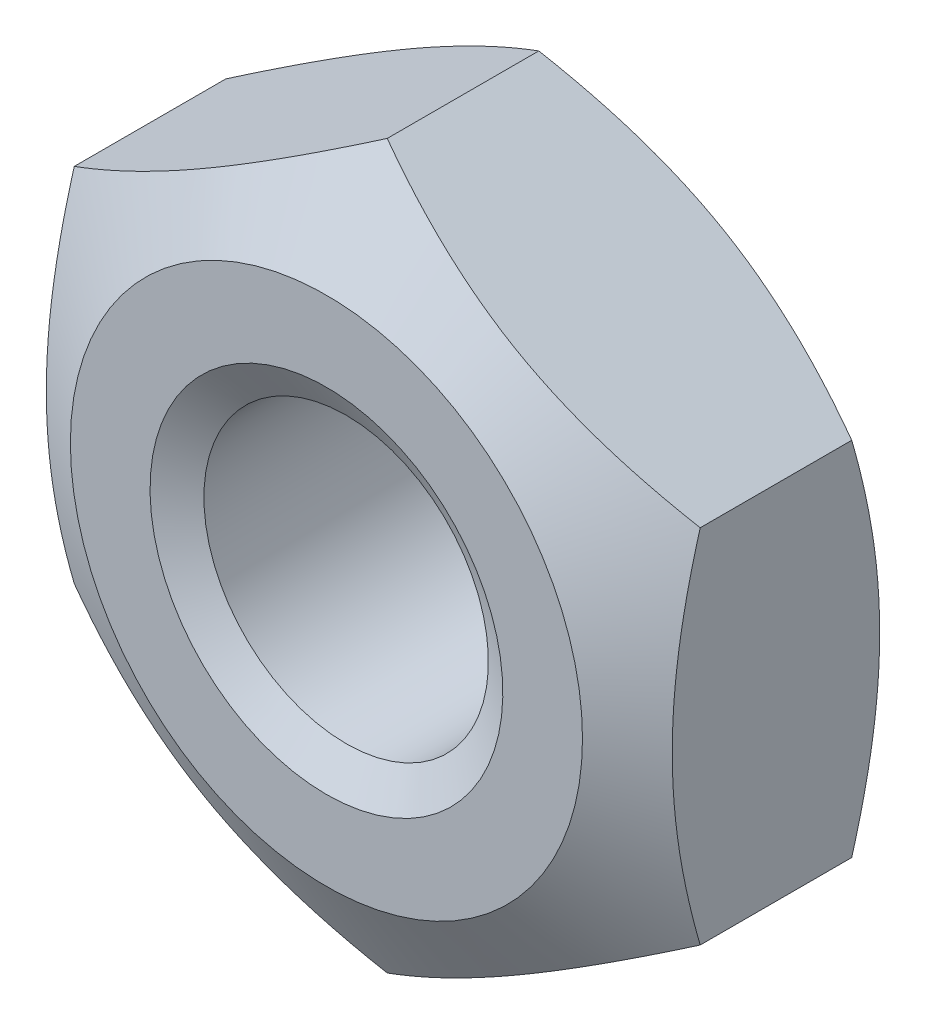
ISO-10303-21;
HEADER;
FILE_DESCRIPTION(('STEP AP214'),'2;1');
FILE_NAME('part.step','',(''),(''),'','','');
FILE_SCHEMA(('AUTOMOTIVE_DESIGN { 1 0 10303 214 1 1 1 1 }'));
ENDSEC;
DATA;
#1=APPLICATION_CONTEXT('core data for automotive mechanical design processes');
#2=APPLICATION_PROTOCOL_DEFINITION('international standard','automotive_design',2000,#1);
#3=PRODUCT_CONTEXT('',#1,'mechanical');
#4=PRODUCT('Part','Part','',(#3));
#5=PRODUCT_RELATED_PRODUCT_CATEGORY('part','',(#4));
#6=PRODUCT_DEFINITION_FORMATION('','',#4);
#7=PRODUCT_DEFINITION_CONTEXT('part definition',#1,'design');
#8=PRODUCT_DEFINITION('design','',#6,#7);
#9=PRODUCT_DEFINITION_SHAPE('','',#8);
#10=(LENGTH_UNIT() NAMED_UNIT(*) SI_UNIT(.MILLI.,.METRE.));
#11=(NAMED_UNIT(*) PLANE_ANGLE_UNIT() SI_UNIT($,.RADIAN.));
#12=(NAMED_UNIT(*) SI_UNIT($,.STERADIAN.) SOLID_ANGLE_UNIT());
#13=UNCERTAINTY_MEASURE_WITH_UNIT(LENGTH_MEASURE(1.E-05),#10,'distance_accuracy_value','');
#14=(GEOMETRIC_REPRESENTATION_CONTEXT(3) GLOBAL_UNCERTAINTY_ASSIGNED_CONTEXT((#13)) GLOBAL_UNIT_ASSIGNED_CONTEXT((#10,
#11,#12)) REPRESENTATION_CONTEXT('',''));
#15=CARTESIAN_POINT('',(0.,0.,0.));
#16=DIRECTION('',(0.,0.,1.));
#17=DIRECTION('',(1.,0.,0.));
#18=AXIS2_PLACEMENT_3D('',#15,#16,#17);
#19=CARTESIAN_POINT('',(0.,0.,-2.4));
#20=DIRECTION('',(0.,0.,1.));
#21=DIRECTION('',(1.,0.,0.));
#22=AXIS2_PLACEMENT_3D('',#19,#20,#21);
#23=PLANE('',#22);
#24=CARTESIAN_POINT('',(0.,0.,-2.4));
#25=DIRECTION('',(0.,0.,1.));
#26=DIRECTION('',(0.,-1.,0.));
#27=AXIS2_PLACEMENT_3D('',#24,#25,#26);
#28=CIRCLE('',#27,1.55);
#29=CARTESIAN_POINT('',(0.,1.55,-2.4));
#30=VERTEX_POINT('',#29);
#31=EDGE_CURVE('E139',#30,#30,#28,.T.);
#32=ORIENTED_EDGE('',*,*,#31,.T.);
#33=EDGE_LOOP('',(#32));
#34=FACE_BOUND('',#33,.T.);
#35=CARTESIAN_POINT('',(0.,0.,-2.4));
#36=DIRECTION('',(0.,0.,1.));
#37=DIRECTION('',(1.,0.,0.));
#38=AXIS2_PLACEMENT_3D('',#35,#36,#37);
#39=CIRCLE('',#38,2.25);
#40=CARTESIAN_POINT('',(-2.25,0.,-2.4));
#41=VERTEX_POINT('',#40);
#42=EDGE_CURVE('E146',#41,#41,#39,.T.);
#43=ORIENTED_EDGE('',*,*,#42,.F.);
#44=EDGE_LOOP('',(#43));
#45=FACE_BOUND('',#44,.T.);
#46=ADVANCED_FACE('F16',(#34,#45),#23,.F.);
#47=CARTESIAN_POINT('',(0.,3.17542648054294,-2.4));
#48=DIRECTION('',(-0.5,0.866025403784437,0.));
#49=DIRECTION('',(0.,0.,1.));
#50=AXIS2_PLACEMENT_3D('',#47,#48,#49);
#51=PLANE('',#50);
#52=DIRECTION('',(0.,0.,1.));
#53=VECTOR('',#52,1.);
#54=CARTESIAN_POINT('',(0.,3.17542648054294,-2.4));
#55=LINE('',#54,#53);
#56=CARTESIAN_POINT('',(0.,3.17542648054294,-1.86570477234333));
#57=VERTEX_POINT('',#56);
#58=CARTESIAN_POINT('',(0.,3.17542648054294,-0.534295227656671));
#59=VERTEX_POINT('',#58);
#60=EDGE_CURVE('E43',#57,#59,#55,.T.);
#61=ORIENTED_EDGE('',*,*,#60,.F.);
#62=CARTESIAN_POINT('',(0.,3.17542648054293,-1.86570477234333));
#63=CARTESIAN_POINT('',(-0.735198963222916,2.75095916121825,-2.11077109341981));
#64=CARTESIAN_POINT('',(-1.37237475922065,2.38308554387785,-2.11132390079117));
#65=CARTESIAN_POINT('',(-1.71319776991422,2.18631128690789,-2.11161959543906));
#66=CARTESIAN_POINT('',(-2.06913878457553,1.98080864627755,-2.04526079267445));
#67=CARTESIAN_POINT('',(-2.39178885101996,1.79452654356181,-1.98510848867109));
#68=CARTESIAN_POINT('',(-2.75000000000001,1.58771324027146,-1.86570477234333));
#69=B_SPLINE_CURVE_WITH_KNOTS('',2,(#62,#63,#64,#65,#66,#67,#68),.UNSPECIFIED.,.F.,.F.,(3,2,2,
3),(0.,0.5,0.75,1.),.UNSPECIFIED.);
#70=CARTESIAN_POINT('',(-2.75,1.58771324027145,-1.86570477234333));
#71=VERTEX_POINT('',#70);
#72=EDGE_CURVE('E204',#57,#71,#69,.T.);
#73=ORIENTED_EDGE('',*,*,#72,.T.);
#74=DIRECTION('',(0.,0.,1.));
#75=VECTOR('',#74,1.);
#76=CARTESIAN_POINT('',(-2.75,1.58771324027145,-2.4));
#77=LINE('',#76,#75);
#78=CARTESIAN_POINT('',(-2.75,1.58771324027145,-0.534295227656671));
#79=VERTEX_POINT('',#78);
#80=EDGE_CURVE('E11',#71,#79,#77,.T.);
#81=ORIENTED_EDGE('',*,*,#80,.T.);
#82=CARTESIAN_POINT('',(-2.75,1.58771324027146,-0.53429522765667));
#83=CARTESIAN_POINT('',(-2.01480103677526,2.0121805595972,-0.28922890657958));
#84=CARTESIAN_POINT('',(-1.37762524077936,2.38005417693655,-0.288676099208825));
#85=CARTESIAN_POINT('',(-1.03680223008299,2.57682843390811,-0.288380404561259));
#86=CARTESIAN_POINT('',(-0.680861215424476,2.78233107453684,-0.354739207325545));
#87=CARTESIAN_POINT('',(-0.3582111489788,2.9686131772533,-0.414891511329325));
#88=CARTESIAN_POINT('',(0.,3.17542648054294,-0.53429522765667));
#89=B_SPLINE_CURVE_WITH_KNOTS('',2,(#82,#83,#84,#85,#86,#87,#88),.UNSPECIFIED.,.F.,.F.,(3,2,2,
3),(0.,0.5,0.75,1.),.UNSPECIFIED.);
#90=EDGE_CURVE('E165',#79,#59,#89,.T.);
#91=ORIENTED_EDGE('',*,*,#90,.T.);
#92=EDGE_LOOP('',(#61,#73,#81,#91));
#93=FACE_BOUND('',#92,.T.);
#94=ADVANCED_FACE('F172',(#93),#51,.T.);
#95=CARTESIAN_POINT('',(-2.75,1.58771324027145,-2.4));
#96=DIRECTION('',(-1.,0.,0.));
#97=DIRECTION('',(0.,1.,0.));
#98=AXIS2_PLACEMENT_3D('',#95,#96,#97);
#99=PLANE('',#98);
#100=ORIENTED_EDGE('',*,*,#80,.F.);
#101=CARTESIAN_POINT('',(-2.75,1.58771324027145,-1.86570477234333));
#102=CARTESIAN_POINT('',(-2.75,1.17689123323059,-1.98429887052036));
#103=CARTESIAN_POINT('',(-2.75,0.805604787080083,-2.04459972433529));
#104=CARTESIAN_POINT('',(-2.74999999999999,0.394762503274745,-2.11132486540519));
#105=CARTESIAN_POINT('',(-2.74999999999999,0.,-2.11132486540519));
#106=B_SPLINE_CURVE_WITH_KNOTS('',2,(#101,#102,#103,#104,#105),.UNSPECIFIED.,.F.,.F.,(3,2,3),
(0.,0.5,1.),.UNSPECIFIED.);
#107=CARTESIAN_POINT('',(-2.75,0.,-2.11132486540519));
#108=VERTEX_POINT('',#107);
#109=EDGE_CURVE('E369',#71,#108,#106,.T.);
#110=ORIENTED_EDGE('',*,*,#109,.T.);
#111=CARTESIAN_POINT('',(-2.74999999999999,0.,-2.11132486540519));
#112=CARTESIAN_POINT('',(-2.74999999999999,-0.391594047866065,-2.11132486540519));
#113=CARTESIAN_POINT('',(-2.74999999999999,-0.79994385497509,-2.04551558581062));
#114=CARTESIAN_POINT('',(-2.74999999999999,-1.17321936405217,-1.98535884784968));
#115=CARTESIAN_POINT('',(-2.74999999999999,-1.58771324027146,-1.86570477234333));
#116=B_SPLINE_CURVE_WITH_KNOTS('',2,(#111,#112,#113,#114,#115),.UNSPECIFIED.,.F.,.F.,(3,2,3),
(0.,0.5,1.),.UNSPECIFIED.);
#117=CARTESIAN_POINT('',(-2.75,-1.58771324027146,-1.86570477234333));
#118=VERTEX_POINT('',#117);
#119=EDGE_CURVE('E361',#108,#118,#116,.T.);
#120=ORIENTED_EDGE('',*,*,#119,.T.);
#121=DIRECTION('',(0.,0.,1.));
#122=VECTOR('',#121,1.);
#123=CARTESIAN_POINT('',(-2.75,-1.58771324027149,-2.4));
#124=LINE('',#123,#122);
#125=CARTESIAN_POINT('',(-2.75,-1.58771324027146,-0.534295227656671));
#126=VERTEX_POINT('',#125);
#127=EDGE_CURVE('E28',#118,#126,#124,.T.);
#128=ORIENTED_EDGE('',*,*,#127,.T.);
#129=CARTESIAN_POINT('',(-2.74999999999999,-1.58771324027146,-0.53429522765667));
#130=CARTESIAN_POINT('',(-2.74999999999999,-1.17381349513734,-0.414812663021295));
#131=CARTESIAN_POINT('',(-2.74999999999999,-0.79994385497509,-0.35448441418938));
#132=CARTESIAN_POINT('',(-2.74999999999999,-0.39210686056957,-0.288675134594815));
#133=CARTESIAN_POINT('',(-2.74999999999999,0.,-0.288675134594815));
#134=B_SPLINE_CURVE_WITH_KNOTS('',2,(#129,#130,#131,#132,#133),.UNSPECIFIED.,.F.,.F.,(3,2,3),
(0.,0.5,1.),.UNSPECIFIED.);
#135=CARTESIAN_POINT('',(-2.75,0.,-0.288675134594814));
#136=VERTEX_POINT('',#135);
#137=EDGE_CURVE('E330',#126,#136,#134,.T.);
#138=ORIENTED_EDGE('',*,*,#137,.T.);
#139=CARTESIAN_POINT('',(-2.74999999999999,0.,-0.288675134594815));
#140=CARTESIAN_POINT('',(-2.74999999999999,0.394249723851525,-0.288675134594815));
#141=CARTESIAN_POINT('',(-2.75,0.805604787080085,-0.355400275664715));
#142=CARTESIAN_POINT('',(-2.75,1.17629685893808,-0.41552954840075));
#143=CARTESIAN_POINT('',(-2.75,1.58771324027145,-0.53429522765667));
#144=B_SPLINE_CURVE_WITH_KNOTS('',2,(#139,#140,#141,#142,#143),.UNSPECIFIED.,.F.,.F.,(3,2,3),
(0.,0.5,1.),.UNSPECIFIED.);
#145=EDGE_CURVE('E155',#136,#79,#144,.T.);
#146=ORIENTED_EDGE('',*,*,#145,.T.);
#147=EDGE_LOOP('',(#100,#110,#120,#128,#138,#146));
#148=FACE_BOUND('',#147,.T.);
#149=ADVANCED_FACE('F182',(#148),#99,.T.);
#150=CARTESIAN_POINT('',(-2.75,-1.58771324027149,-2.4));
#151=DIRECTION('',(-0.5,-0.866025403784441,0.));
#152=DIRECTION('',(-0.866025403784441,0.5,0.));
#153=AXIS2_PLACEMENT_3D('',#150,#151,#152);
#154=PLANE('',#153);
#155=ORIENTED_EDGE('',*,*,#127,.F.);
#156=CARTESIAN_POINT('',(-2.75000000000001,-1.58771324027148,-1.86570477234333));
#157=CARTESIAN_POINT('',(-2.01480103677615,-2.01218055959671,-2.11077109342011));
#158=CARTESIAN_POINT('',(-1.37762524077937,-2.38005417693657,-2.11132390079116));
#159=CARTESIAN_POINT('',(-1.03680223008323,-2.576828433908,-2.11161959543889));
#160=CARTESIAN_POINT('',(-0.680861215424486,-2.78233107453686,-2.04526079267445));
#161=CARTESIAN_POINT('',(-0.358211148978063,-2.96861317725375,-1.98510848867043));
#162=CARTESIAN_POINT('',(0.,-3.17542648054295,-1.86570477234333));
#163=B_SPLINE_CURVE_WITH_KNOTS('',2,(#156,#157,#158,#159,#160,#161,#162),.UNSPECIFIED.,.F.,.F.,
(3,2,2,3),(0.,0.5,0.75,1.),.UNSPECIFIED.);
#164=CARTESIAN_POINT('',(0.,-3.17542648054294,-1.86570477234333));
#165=VERTEX_POINT('',#164);
#166=EDGE_CURVE('E354',#118,#165,#163,.T.);
#167=ORIENTED_EDGE('',*,*,#166,.T.);
#168=DIRECTION('',(0.,0.,1.));
#169=VECTOR('',#168,1.);
#170=CARTESIAN_POINT('',(0.,-3.17542648054295,-2.4));
#171=LINE('',#170,#169);
#172=CARTESIAN_POINT('',(0.,-3.17542648054294,-0.534295227656671));
#173=VERTEX_POINT('',#172);
#174=EDGE_CURVE('E453',#165,#173,#171,.T.);
#175=ORIENTED_EDGE('',*,*,#174,.T.);
#176=CARTESIAN_POINT('',(0.,-3.17542648054295,-0.534295227656662));
#177=CARTESIAN_POINT('',(-0.735198963223831,-2.75095916121775,-0.289228906579881));
#178=CARTESIAN_POINT('',(-1.37237475922065,-2.38308554387787,-0.288676099208827));
#179=CARTESIAN_POINT('',(-1.71319776991593,-2.18631128690693,-0.288380404561102));
#180=CARTESIAN_POINT('',(-2.06913878457553,-1.98080864627758,-0.354739207325547));
#181=CARTESIAN_POINT('',(-2.39178885102091,-1.79452654356129,-0.414891511329232));
#182=CARTESIAN_POINT('',(-2.75000000000001,-1.58771324027148,-0.534295227656662));
#183=B_SPLINE_CURVE_WITH_KNOTS('',2,(#176,#177,#178,#179,#180,#181,#182),.UNSPECIFIED.,.F.,.F.,
(3,2,2,3),(0.,0.5,0.75,1.),.UNSPECIFIED.);
#184=EDGE_CURVE('E333',#173,#126,#183,.T.);
#185=ORIENTED_EDGE('',*,*,#184,.T.);
#186=EDGE_LOOP('',(#155,#167,#175,#185));
#187=FACE_BOUND('',#186,.T.);
#188=ADVANCED_FACE('F279',(#187),#154,.T.);
#189=CARTESIAN_POINT('',(0.,-3.17542648054295,-2.4));
#190=DIRECTION('',(0.500000000000006,-0.866025403784435,0.));
#191=DIRECTION('',(0.,0.,-1.));
#192=AXIS2_PLACEMENT_3D('',#189,#190,#191);
#193=PLANE('',#192);
#194=ORIENTED_EDGE('',*,*,#174,.F.);
#195=CARTESIAN_POINT('',(0.,-3.17542648054296,-1.86570477234333));
#196=CARTESIAN_POINT('',(0.735198963223873,-2.75095916121772,-2.11077109342011));
#197=CARTESIAN_POINT('',(1.37237475922064,-2.38308554387786,-2.11132390079116));
#198=CARTESIAN_POINT('',(1.71319776991638,-2.18631128690666,-2.11161959543889));
#199=CARTESIAN_POINT('',(2.06913878457552,-1.98080864627757,-2.04526079267445));
#200=CARTESIAN_POINT('',(2.39178885102144,-1.79452654356096,-1.98510848867059));
#201=CARTESIAN_POINT('',(2.74999999999999,-1.58771324027147,-1.86570477234333));
#202=B_SPLINE_CURVE_WITH_KNOTS('',2,(#195,#196,#197,#198,#199,#200,#201),.UNSPECIFIED.,.F.,.F.,
(3,2,2,3),(0.,0.5,0.75,1.),.UNSPECIFIED.);
#203=CARTESIAN_POINT('',(2.75,-1.58771324027147,-1.86570477234333));
#204=VERTEX_POINT('',#203);
#205=EDGE_CURVE('E307',#165,#204,#202,.T.);
#206=ORIENTED_EDGE('',*,*,#205,.T.);
#207=DIRECTION('',(0.,0.,1.));
#208=VECTOR('',#207,1.);
#209=CARTESIAN_POINT('',(2.75,-1.58771324027146,-2.4));
#210=LINE('',#209,#208);
#211=CARTESIAN_POINT('',(2.75,-1.58771324027147,-0.534295227656671));
#212=VERTEX_POINT('',#211);
#213=EDGE_CURVE('E304',#204,#212,#210,.T.);
#214=ORIENTED_EDGE('',*,*,#213,.T.);
#215=CARTESIAN_POINT('',(2.74999999999999,-1.58771324027147,-0.53429522765667));
#216=CARTESIAN_POINT('',(2.01480103677618,-2.01218055959668,-0.28922890657989));
#217=CARTESIAN_POINT('',(1.37762524077936,-2.38005417693656,-0.288676099208835));
#218=CARTESIAN_POINT('',(1.03680223008409,-2.5768284339075,-0.28838040456111));
#219=CARTESIAN_POINT('',(0.68086121542448,-2.78233107453686,-0.35473920732556));
#220=CARTESIAN_POINT('',(0.358211148979121,-2.96861317725314,-0.41489151132924));
#221=CARTESIAN_POINT('',(0.,-3.17542648054296,-0.53429522765667));
#222=B_SPLINE_CURVE_WITH_KNOTS('',2,(#215,#216,#217,#218,#219,#220,#221),.UNSPECIFIED.,.F.,.F.,
(3,2,2,3),(0.,0.5,0.75,1.),.UNSPECIFIED.);
#223=EDGE_CURVE('E340',#212,#173,#222,.T.);
#224=ORIENTED_EDGE('',*,*,#223,.T.);
#225=EDGE_LOOP('',(#194,#206,#214,#224));
#226=FACE_BOUND('',#225,.T.);
#227=ADVANCED_FACE('F278',(#226),#193,.T.);
#228=CARTESIAN_POINT('',(2.75,-1.58771324027146,-2.4));
#229=DIRECTION('',(1.,0.,0.));
#230=DIRECTION('',(0.,1.,0.));
#231=AXIS2_PLACEMENT_3D('',#228,#229,#230);
#232=PLANE('',#231);
#233=ORIENTED_EDGE('',*,*,#213,.F.);
#234=CARTESIAN_POINT('',(2.75,-1.58771324027147,-1.86570477234333));
#235=CARTESIAN_POINT('',(2.75,-1.17381349513741,-1.98518733697868));
#236=CARTESIAN_POINT('',(2.75,-0.799943854975089,-2.04551558581062));
#237=CARTESIAN_POINT('',(2.75,-0.392106860569635,-2.11132486540519));
#238=CARTESIAN_POINT('',(2.75,0.,-2.11132486540519));
#239=B_SPLINE_CURVE_WITH_KNOTS('',2,(#234,#235,#236,#237,#238),.UNSPECIFIED.,.F.,.F.,(3,2,3),
(0.,0.5,1.),.UNSPECIFIED.);
#240=CARTESIAN_POINT('',(2.75,0.,-2.11132486540519));
#241=VERTEX_POINT('',#240);
#242=EDGE_CURVE('E302',#204,#241,#239,.T.);
#243=ORIENTED_EDGE('',*,*,#242,.T.);
#244=CARTESIAN_POINT('',(2.75,0.,-2.11132486540519));
#245=CARTESIAN_POINT('',(2.75,0.39424972385129,-2.11132486540519));
#246=CARTESIAN_POINT('',(2.75,0.805604787080095,-2.04459972433529));
#247=CARTESIAN_POINT('',(2.75,1.17629685893782,-1.98447045159934));
#248=CARTESIAN_POINT('',(2.75,1.58771324027146,-1.86570477234333));
#249=B_SPLINE_CURVE_WITH_KNOTS('',2,(#244,#245,#246,#247,#248),.UNSPECIFIED.,.F.,.F.,(3,2,3),
(0.,0.5,1.),.UNSPECIFIED.);
#250=CARTESIAN_POINT('',(2.75,1.58771324027146,-1.86570477234333));
#251=VERTEX_POINT('',#250);
#252=EDGE_CURVE('E159',#241,#251,#249,.T.);
#253=ORIENTED_EDGE('',*,*,#252,.T.);
#254=DIRECTION('',(0.,0.,1.));
#255=VECTOR('',#254,1.);
#256=CARTESIAN_POINT('',(2.75,1.5877132402715,-2.4));
#257=LINE('',#256,#255);
#258=CARTESIAN_POINT('',(2.75,1.58771324027146,-0.534295227656671));
#259=VERTEX_POINT('',#258);
#260=EDGE_CURVE('E324',#251,#259,#257,.T.);
#261=ORIENTED_EDGE('',*,*,#260,.T.);
#262=CARTESIAN_POINT('',(2.75,1.58771324027146,-0.53429522765667));
#263=CARTESIAN_POINT('',(2.75,1.17689123323056,-0.41570112947962));
#264=CARTESIAN_POINT('',(2.75,0.805604787080095,-0.35540027566471));
#265=CARTESIAN_POINT('',(2.75,0.394762503274715,-0.28867513459481));
#266=CARTESIAN_POINT('',(2.75,0.,-0.28867513459481));
#267=B_SPLINE_CURVE_WITH_KNOTS('',2,(#262,#263,#264,#265,#266),.UNSPECIFIED.,.F.,.F.,(3,2,3),
(0.,0.5,1.),.UNSPECIFIED.);
#268=CARTESIAN_POINT('',(2.75,0.,-0.28867513459481));
#269=VERTEX_POINT('',#268);
#270=EDGE_CURVE('E317',#259,#269,#267,.T.);
#271=ORIENTED_EDGE('',*,*,#270,.T.);
#272=CARTESIAN_POINT('',(2.75,0.,-0.28867513459481));
#273=CARTESIAN_POINT('',(2.75,-0.391594047866043,-0.28867513459481));
#274=CARTESIAN_POINT('',(2.75,-0.799943854975088,-0.35448441418938));
#275=CARTESIAN_POINT('',(2.75,-1.17321936405215,-0.414641152150315));
#276=CARTESIAN_POINT('',(2.75,-1.58771324027147,-0.53429522765667));
#277=B_SPLINE_CURVE_WITH_KNOTS('',2,(#272,#273,#274,#275,#276),.UNSPECIFIED.,.F.,.F.,(3,2,3),
(0.,0.5,1.),.UNSPECIFIED.);
#278=EDGE_CURVE('E321',#269,#212,#277,.T.);
#279=ORIENTED_EDGE('',*,*,#278,.T.);
#280=EDGE_LOOP('',(#233,#243,#253,#261,#271,#279));
#281=FACE_BOUND('',#280,.T.);
#282=ADVANCED_FACE('F269',(#281),#232,.T.);
#283=CARTESIAN_POINT('',(2.75,1.5877132402715,-2.4));
#284=DIRECTION('',(0.499999999999993,0.866025403784443,0.));
#285=DIRECTION('',(0.,0.,-1.));
#286=AXIS2_PLACEMENT_3D('',#283,#284,#285);
#287=PLANE('',#286);
#288=ORIENTED_EDGE('',*,*,#260,.F.);
#289=CARTESIAN_POINT('',(2.75000000000001,1.58771324027149,-1.86570477234333));
#290=CARTESIAN_POINT('',(2.01480103677614,2.01218055959672,-2.11077109342011));
#291=CARTESIAN_POINT('',(1.37762524077936,2.38005417693656,-2.11132390079116));
#292=CARTESIAN_POINT('',(1.0368022300798,2.57682843390997,-2.11161959543889));
#293=CARTESIAN_POINT('',(0.680861215424481,2.78233107453684,-2.04526079267445));
#294=CARTESIAN_POINT('',(0.358211148974125,2.968613177256,-1.98510848866911));
#295=CARTESIAN_POINT('',(0.,3.17542648054294,-1.86570477234333));
#296=B_SPLINE_CURVE_WITH_KNOTS('',2,(#289,#290,#291,#292,#293,#294,#295),.UNSPECIFIED.,.F.,.F.,
(3,2,2,3),(0.,0.5,0.75,1.),.UNSPECIFIED.);
#297=EDGE_CURVE('E156',#251,#57,#296,.T.);
#298=ORIENTED_EDGE('',*,*,#297,.T.);
#299=ORIENTED_EDGE('',*,*,#60,.T.);
#300=CARTESIAN_POINT('',(0.,3.17542648054293,-0.53429522765667));
#301=CARTESIAN_POINT('',(0.735198963223822,2.75095916121774,-0.28922890657989));
#302=CARTESIAN_POINT('',(1.37237475922065,2.38308554387786,-0.288676099208835));
#303=CARTESIAN_POINT('',(1.71319776991585,2.18631128690697,-0.28838040456111));
#304=CARTESIAN_POINT('',(2.06913878457553,1.98080864627758,-0.35473920732556));
#305=CARTESIAN_POINT('',(2.39178885102081,1.79452654356135,-0.41489151132921));
#306=CARTESIAN_POINT('',(2.75000000000001,1.58771324027149,-0.53429522765667));
#307=B_SPLINE_CURVE_WITH_KNOTS('',2,(#300,#301,#302,#303,#304,#305,#306),.UNSPECIFIED.,.F.,.F.,
(3,2,2,3),(0.,0.5,0.75,1.),.UNSPECIFIED.);
#308=EDGE_CURVE('E320',#59,#259,#307,.T.);
#309=ORIENTED_EDGE('',*,*,#308,.T.);
#310=EDGE_LOOP('',(#288,#298,#299,#309));
#311=FACE_BOUND('',#310,.T.);
#312=ADVANCED_FACE('F183',(#311),#287,.T.);
#313=CARTESIAN_POINT('',(0.,0.,0.));
#314=DIRECTION('',(0.,0.,1.));
#315=DIRECTION('',(1.,0.,0.));
#316=AXIS2_PLACEMENT_3D('',#313,#314,#315);
#317=PLANE('',#316);
#318=CARTESIAN_POINT('',(0.,0.,0.));
#319=DIRECTION('',(0.,0.,1.));
#320=DIRECTION('',(0.,-1.,0.));
#321=AXIS2_PLACEMENT_3D('',#318,#319,#320);
#322=CIRCLE('',#321,1.55);
#323=CARTESIAN_POINT('',(0.,-1.55,0.));
#324=VERTEX_POINT('',#323);
#325=EDGE_CURVE('E138',#324,#324,#322,.T.);
#326=ORIENTED_EDGE('',*,*,#325,.F.);
#327=EDGE_LOOP('',(#326));
#328=FACE_BOUND('',#327,.T.);
#329=CARTESIAN_POINT('',(0.,0.,0.));
#330=DIRECTION('',(0.,0.,1.));
#331=DIRECTION('',(1.,0.,0.));
#332=AXIS2_PLACEMENT_3D('',#329,#330,#331);
#333=CIRCLE('',#332,2.25);
#334=CARTESIAN_POINT('',(-2.25,0.,0.));
#335=VERTEX_POINT('',#334);
#336=EDGE_CURVE('E152',#335,#335,#333,.T.);
#337=ORIENTED_EDGE('',*,*,#336,.T.);
#338=EDGE_LOOP('',(#337));
#339=FACE_BOUND('',#338,.T.);
#340=ADVANCED_FACE('F467',(#328,#339),#317,.T.);
#341=CARTESIAN_POINT('',(0.,0.,0.));
#342=DIRECTION('',(0.,0.,-1.));
#343=DIRECTION('',(-1.,0.,0.));
#344=AXIS2_PLACEMENT_3D('',#341,#342,#343);
#345=CONICAL_SURFACE('',#344,2.25,1.0471975511966);
#346=ORIENTED_EDGE('',*,*,#145,.F.);
#347=ORIENTED_EDGE('',*,*,#137,.F.);
#348=ORIENTED_EDGE('',*,*,#184,.F.);
#349=ORIENTED_EDGE('',*,*,#223,.F.);
#350=ORIENTED_EDGE('',*,*,#278,.F.);
#351=ORIENTED_EDGE('',*,*,#270,.F.);
#352=ORIENTED_EDGE('',*,*,#308,.F.);
#353=ORIENTED_EDGE('',*,*,#90,.F.);
#354=EDGE_LOOP('',(#346,#347,#348,#349,#350,#351,#352,#353));
#355=FACE_BOUND('',#354,.T.);
#356=ORIENTED_EDGE('',*,*,#336,.F.);
#357=EDGE_LOOP('',(#356));
#358=FACE_BOUND('',#357,.T.);
#359=ADVANCED_FACE('F218',(#355,#358),#345,.T.);
#360=CARTESIAN_POINT('',(0.,0.,-1.86570477234333));
#361=DIRECTION('',(0.,0.,1.));
#362=DIRECTION('',(1.,0.,0.));
#363=AXIS2_PLACEMENT_3D('',#360,#361,#362);
#364=CONICAL_SURFACE('',#363,3.17542648054294,1.0471975511966);
#365=ORIENTED_EDGE('',*,*,#252,.F.);
#366=ORIENTED_EDGE('',*,*,#242,.F.);
#367=ORIENTED_EDGE('',*,*,#205,.F.);
#368=ORIENTED_EDGE('',*,*,#166,.F.);
#369=ORIENTED_EDGE('',*,*,#119,.F.);
#370=ORIENTED_EDGE('',*,*,#109,.F.);
#371=ORIENTED_EDGE('',*,*,#72,.F.);
#372=ORIENTED_EDGE('',*,*,#297,.F.);
#373=EDGE_LOOP('',(#365,#366,#367,#368,#369,#370,#371,#372));
#374=FACE_BOUND('',#373,.T.);
#375=ORIENTED_EDGE('',*,*,#42,.T.);
#376=EDGE_LOOP('',(#375));
#377=FACE_BOUND('',#376,.T.);
#378=ADVANCED_FACE('F209',(#374,#377),#364,.T.);
#379=CARTESIAN_POINT('',(0.,0.,-0.173205080756887));
#380=DIRECTION('',(0.,0.,1.));
#381=DIRECTION('',(0.,-1.,0.));
#382=AXIS2_PLACEMENT_3D('',#379,#380,#381);
#383=CONICAL_SURFACE('',#382,1.25,1.0471975511966);
#384=ORIENTED_EDGE('',*,*,#325,.T.);
#385=EDGE_LOOP('',(#384));
#386=FACE_BOUND('',#385,.T.);
#387=CARTESIAN_POINT('',(0.,0.,-0.173205080756887));
#388=DIRECTION('',(0.,0.,1.));
#389=DIRECTION('',(0.,-1.,0.));
#390=AXIS2_PLACEMENT_3D('',#387,#388,#389);
#391=CIRCLE('',#390,1.25);
#392=CARTESIAN_POINT('',(0.,-1.25,-0.173205080756888));
#393=VERTEX_POINT('',#392);
#394=EDGE_CURVE('E133',#393,#393,#391,.T.);
#395=ORIENTED_EDGE('',*,*,#394,.F.);
#396=EDGE_LOOP('',(#395));
#397=FACE_BOUND('',#396,.T.);
#398=ADVANCED_FACE('F18',(#386,#397),#383,.F.);
#399=CARTESIAN_POINT('',(0.,0.,0.));
#400=DIRECTION('',(0.,0.,1.));
#401=DIRECTION('',(0.,-1.,0.));
#402=AXIS2_PLACEMENT_3D('',#399,#400,#401);
#403=CYLINDRICAL_SURFACE('',#402,1.25);
#404=ORIENTED_EDGE('',*,*,#394,.T.);
#405=EDGE_LOOP('',(#404));
#406=FACE_BOUND('',#405,.T.);
#407=CARTESIAN_POINT('',(0.,0.,-2.22679491924313));
#408=DIRECTION('',(0.,0.,1.));
#409=DIRECTION('',(0.,-1.,0.));
#410=AXIS2_PLACEMENT_3D('',#407,#408,#409);
#411=CIRCLE('',#410,1.25);
#412=CARTESIAN_POINT('',(0.,-1.25,-2.22679491924313));
#413=VERTEX_POINT('',#412);
#414=EDGE_CURVE('E149',#413,#413,#411,.T.);
#415=ORIENTED_EDGE('',*,*,#414,.F.);
#416=EDGE_LOOP('',(#415));
#417=FACE_BOUND('',#416,.T.);
#418=ADVANCED_FACE('F134',(#406,#417),#403,.F.);
#419=CARTESIAN_POINT('',(0.,0.,-2.4));
#420=DIRECTION('',(0.,0.,-1.));
#421=DIRECTION('',(0.,1.,0.));
#422=AXIS2_PLACEMENT_3D('',#419,#420,#421);
#423=CONICAL_SURFACE('',#422,1.55,1.04719755119664);
#424=ORIENTED_EDGE('',*,*,#31,.F.);
#425=EDGE_LOOP('',(#424));
#426=FACE_BOUND('',#425,.T.);
#427=ORIENTED_EDGE('',*,*,#414,.T.);
#428=EDGE_LOOP('',(#427));
#429=FACE_BOUND('',#428,.T.);
#430=ADVANCED_FACE('F219',(#426,#429),#423,.F.);
#431=CLOSED_SHELL('',(#46,#94,#149,#188,#227,#282,#312,#340,#359,#378,#398,#418,#430));
#432=MANIFOLD_SOLID_BREP('B1',#431);
#433=ADVANCED_BREP_SHAPE_REPRESENTATION('',(#18,#432),#14);
#434=SHAPE_DEFINITION_REPRESENTATION(#9,#433);
ENDSEC;
END-ISO-10303-21;
